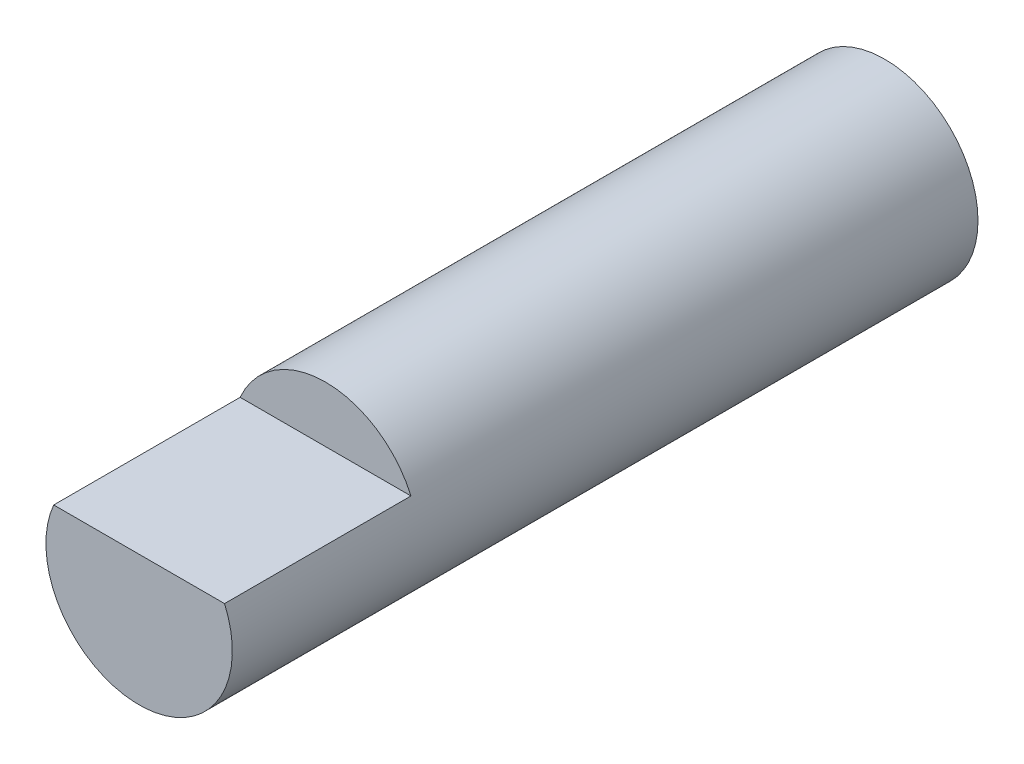
ISO-10303-21;
HEADER;
FILE_DESCRIPTION(('STEP AP214'),'2;1');
FILE_NAME('part.step','',(''),(''),'','','');
FILE_SCHEMA(('AUTOMOTIVE_DESIGN { 1 0 10303 214 1 1 1 1 }'));
ENDSEC;
DATA;
#1=APPLICATION_CONTEXT('core data for automotive mechanical design processes');
#2=APPLICATION_PROTOCOL_DEFINITION('international standard','automotive_design',2000,#1);
#3=PRODUCT_CONTEXT('',#1,'mechanical');
#4=PRODUCT('Part','Part','',(#3));
#5=PRODUCT_RELATED_PRODUCT_CATEGORY('part','',(#4));
#6=PRODUCT_DEFINITION_FORMATION('','',#4);
#7=PRODUCT_DEFINITION_CONTEXT('part definition',#1,'design');
#8=PRODUCT_DEFINITION('design','',#6,#7);
#9=PRODUCT_DEFINITION_SHAPE('','',#8);
#10=(LENGTH_UNIT() NAMED_UNIT(*) SI_UNIT(.MILLI.,.METRE.));
#11=(NAMED_UNIT(*) PLANE_ANGLE_UNIT() SI_UNIT($,.RADIAN.));
#12=(NAMED_UNIT(*) SI_UNIT($,.STERADIAN.) SOLID_ANGLE_UNIT());
#13=UNCERTAINTY_MEASURE_WITH_UNIT(LENGTH_MEASURE(1.E-05),#10,'distance_accuracy_value','');
#14=(GEOMETRIC_REPRESENTATION_CONTEXT(3) GLOBAL_UNCERTAINTY_ASSIGNED_CONTEXT((#13)) GLOBAL_UNIT_ASSIGNED_CONTEXT((#10,
#11,#12)) REPRESENTATION_CONTEXT('',''));
#15=CARTESIAN_POINT('',(0.,0.,0.));
#16=DIRECTION('',(0.,0.,1.));
#17=DIRECTION('',(1.,0.,0.));
#18=AXIS2_PLACEMENT_3D('',#15,#16,#17);
#19=CARTESIAN_POINT('',(0.,0.,25.4));
#20=DIRECTION('',(0.,0.,-1.));
#21=DIRECTION('',(-1.,0.,0.));
#22=AXIS2_PLACEMENT_3D('',#19,#20,#21);
#23=CYLINDRICAL_SURFACE('',#22,3.175);
#24=CARTESIAN_POINT('',(0.,0.,25.4));
#25=DIRECTION('',(0.,0.,1.));
#26=DIRECTION('',(1.,0.,0.));
#27=AXIS2_PLACEMENT_3D('',#24,#25,#26);
#28=CIRCLE('',#27,3.175);
#29=CARTESIAN_POINT('',(-2.90993556629696,1.27,25.4));
#30=VERTEX_POINT('',#29);
#31=CARTESIAN_POINT('',(2.90993556629696,1.27,25.4));
#32=VERTEX_POINT('',#31);
#33=EDGE_CURVE('E73',#30,#32,#28,.T.);
#34=ORIENTED_EDGE('',*,*,#33,.F.);
#35=DIRECTION('',(0.,0.,-1.));
#36=VECTOR('',#35,1.);
#37=CARTESIAN_POINT('',(-2.90993556629696,1.27,25.4));
#38=LINE('',#37,#36);
#39=CARTESIAN_POINT('',(-2.90993556629696,1.27,19.05));
#40=VERTEX_POINT('',#39);
#41=EDGE_CURVE('E57',#30,#40,#38,.T.);
#42=ORIENTED_EDGE('',*,*,#41,.T.);
#43=CARTESIAN_POINT('',(0.,0.,19.05));
#44=DIRECTION('',(0.,0.,1.));
#45=DIRECTION('',(1.,0.,0.));
#46=AXIS2_PLACEMENT_3D('',#43,#44,#45);
#47=CIRCLE('',#46,3.175);
#48=CARTESIAN_POINT('',(2.90993556629696,1.27,19.05));
#49=VERTEX_POINT('',#48);
#50=EDGE_CURVE('E11',#49,#40,#47,.T.);
#51=ORIENTED_EDGE('',*,*,#50,.F.);
#52=DIRECTION('',(0.,0.,-1.));
#53=VECTOR('',#52,1.);
#54=CARTESIAN_POINT('',(2.90993556629696,1.27,25.4));
#55=LINE('',#54,#53);
#56=EDGE_CURVE('E63',#49,#32,#55,.F.);
#57=ORIENTED_EDGE('',*,*,#56,.T.);
#58=EDGE_LOOP('',(#34,#42,#51,#57));
#59=FACE_BOUND('',#58,.T.);
#60=CARTESIAN_POINT('',(0.,0.,0.));
#61=DIRECTION('',(0.,0.,1.));
#62=DIRECTION('',(1.,0.,0.));
#63=AXIS2_PLACEMENT_3D('',#60,#61,#62);
#64=CIRCLE('',#63,3.175);
#65=CARTESIAN_POINT('',(3.175,0.,0.));
#66=VERTEX_POINT('',#65);
#67=EDGE_CURVE('E82',#66,#66,#64,.T.);
#68=ORIENTED_EDGE('',*,*,#67,.T.);
#69=EDGE_LOOP('',(#68));
#70=FACE_BOUND('',#69,.T.);
#71=ADVANCED_FACE('F39',(#59,#70),#23,.T.);
#72=CARTESIAN_POINT('',(0.,0.,25.4));
#73=DIRECTION('',(0.,0.,1.));
#74=DIRECTION('',(1.,0.,0.));
#75=AXIS2_PLACEMENT_3D('',#72,#73,#74);
#76=PLANE('',#75);
#77=DIRECTION('',(1.,0.,0.));
#78=VECTOR('',#77,1.);
#79=CARTESIAN_POINT('',(0.,1.27,25.4));
#80=LINE('',#79,#78);
#81=EDGE_CURVE('E47',#30,#32,#80,.T.);
#82=ORIENTED_EDGE('',*,*,#81,.F.);
#83=ORIENTED_EDGE('',*,*,#33,.T.);
#84=EDGE_LOOP('',(#82,#83));
#85=FACE_BOUND('',#84,.T.);
#86=ADVANCED_FACE('F80',(#85),#76,.T.);
#87=CARTESIAN_POINT('',(0.,0.,0.));
#88=DIRECTION('',(0.,0.,1.));
#89=DIRECTION('',(1.,0.,0.));
#90=AXIS2_PLACEMENT_3D('',#87,#88,#89);
#91=PLANE('',#90);
#92=ORIENTED_EDGE('',*,*,#67,.F.);
#93=EDGE_LOOP('',(#92));
#94=FACE_BOUND('',#93,.T.);
#95=ADVANCED_FACE('F94',(#94),#91,.F.);
#96=CARTESIAN_POINT('',(0.,1.27,19.05));
#97=DIRECTION('',(0.,0.,1.));
#98=DIRECTION('',(1.,0.,0.));
#99=AXIS2_PLACEMENT_3D('',#96,#97,#98);
#100=PLANE('',#99);
#101=ORIENTED_EDGE('',*,*,#50,.T.);
#102=DIRECTION('',(1.,0.,0.));
#103=VECTOR('',#102,1.);
#104=CARTESIAN_POINT('',(-6.35,1.27,19.05));
#105=LINE('',#104,#103);
#106=EDGE_CURVE('E78',#40,#49,#105,.T.);
#107=ORIENTED_EDGE('',*,*,#106,.T.);
#108=EDGE_LOOP('',(#101,#107));
#109=FACE_BOUND('',#108,.T.);
#110=ADVANCED_FACE('F92',(#109),#100,.T.);
#111=CARTESIAN_POINT('',(-6.35,1.27,19.05));
#112=DIRECTION('',(0.,-1.,0.));
#113=DIRECTION('',(0.,0.,-1.));
#114=AXIS2_PLACEMENT_3D('',#111,#112,#113);
#115=PLANE('',#114);
#116=ORIENTED_EDGE('',*,*,#81,.T.);
#117=ORIENTED_EDGE('',*,*,#56,.F.);
#118=ORIENTED_EDGE('',*,*,#106,.F.);
#119=ORIENTED_EDGE('',*,*,#41,.F.);
#120=EDGE_LOOP('',(#116,#117,#118,#119));
#121=FACE_BOUND('',#120,.T.);
#122=ADVANCED_FACE('F68',(#121),#115,.F.);
#123=CLOSED_SHELL('',(#71,#86,#95,#110,#122));
#124=MANIFOLD_SOLID_BREP('B2',#123);
#125=ADVANCED_BREP_SHAPE_REPRESENTATION('',(#18,#124),#14);
#126=SHAPE_DEFINITION_REPRESENTATION(#9,#125);
ENDSEC;
END-ISO-10303-21;
